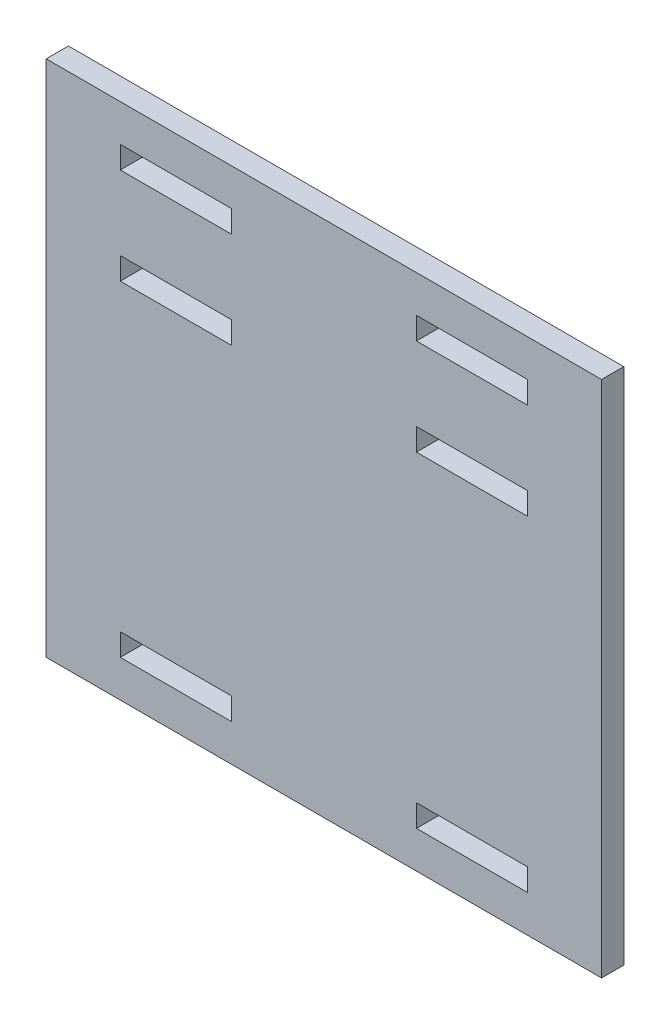
ISO-10303-21;
HEADER;
FILE_DESCRIPTION(('STEP AP214'),'2;1');
FILE_NAME('part.step','',(''),(''),'','','');
FILE_SCHEMA(('AUTOMOTIVE_DESIGN { 1 0 10303 214 1 1 1 1 }'));
ENDSEC;
DATA;
#1=APPLICATION_CONTEXT('core data for automotive mechanical design processes');
#2=APPLICATION_PROTOCOL_DEFINITION('international standard','automotive_design',2000,#1);
#3=PRODUCT_CONTEXT('',#1,'mechanical');
#4=PRODUCT('Part','Part','',(#3));
#5=PRODUCT_RELATED_PRODUCT_CATEGORY('part','',(#4));
#6=PRODUCT_DEFINITION_FORMATION('','',#4);
#7=PRODUCT_DEFINITION_CONTEXT('part definition',#1,'design');
#8=PRODUCT_DEFINITION('design','',#6,#7);
#9=PRODUCT_DEFINITION_SHAPE('','',#8);
#10=(LENGTH_UNIT() NAMED_UNIT(*) SI_UNIT(.MILLI.,.METRE.));
#11=(NAMED_UNIT(*) PLANE_ANGLE_UNIT() SI_UNIT($,.RADIAN.));
#12=(NAMED_UNIT(*) SI_UNIT($,.STERADIAN.) SOLID_ANGLE_UNIT());
#13=UNCERTAINTY_MEASURE_WITH_UNIT(LENGTH_MEASURE(1.E-05),#10,'distance_accuracy_value','');
#14=(GEOMETRIC_REPRESENTATION_CONTEXT(3) GLOBAL_UNCERTAINTY_ASSIGNED_CONTEXT((#13)) GLOBAL_UNIT_ASSIGNED_CONTEXT((#10,
#11,#12)) REPRESENTATION_CONTEXT('',''));
#15=CARTESIAN_POINT('',(0.,0.,0.));
#16=DIRECTION('',(0.,0.,1.));
#17=DIRECTION('',(1.,0.,0.));
#18=AXIS2_PLACEMENT_3D('',#15,#16,#17);
#19=CARTESIAN_POINT('',(0.,0.,3.));
#20=DIRECTION('',(0.,0.,1.));
#21=DIRECTION('',(1.,0.,0.));
#22=AXIS2_PLACEMENT_3D('',#19,#20,#21);
#23=PLANE('',#22);
#24=DIRECTION('',(1.,0.,0.));
#25=VECTOR('',#24,1.);
#26=CARTESIAN_POINT('',(-40.1836734693878,11.1632653061225,3.));
#27=LINE('',#26,#25);
#28=CARTESIAN_POINT('',(-40.1836734693878,11.1632653061225,3.));
#29=VERTEX_POINT('',#28);
#30=CARTESIAN_POINT('',(-25.1836734693878,11.1632653061225,3.));
#31=VERTEX_POINT('',#30);
#32=EDGE_CURVE('E258',#29,#31,#27,.T.);
#33=ORIENTED_EDGE('',*,*,#32,.F.);
#34=DIRECTION('',(0.,-1.,0.));
#35=VECTOR('',#34,1.);
#36=CARTESIAN_POINT('',(-40.1836734693878,14.1632653061225,3.));
#37=LINE('',#36,#35);
#38=CARTESIAN_POINT('',(-40.1836734693878,14.1632653061225,3.));
#39=VERTEX_POINT('',#38);
#40=EDGE_CURVE('E256',#39,#29,#37,.T.);
#41=ORIENTED_EDGE('',*,*,#40,.F.);
#42=DIRECTION('',(-1.,0.,0.));
#43=VECTOR('',#42,1.);
#44=CARTESIAN_POINT('',(-40.1836734693878,14.1632653061225,3.));
#45=LINE('',#44,#43);
#46=CARTESIAN_POINT('',(-25.1836734693878,14.1632653061225,3.));
#47=VERTEX_POINT('',#46);
#48=EDGE_CURVE('E264',#47,#39,#45,.T.);
#49=ORIENTED_EDGE('',*,*,#48,.F.);
#50=DIRECTION('',(0.,1.,0.));
#51=VECTOR('',#50,1.);
#52=CARTESIAN_POINT('',(-25.1836734693878,14.1632653061225,3.));
#53=LINE('',#52,#51);
#54=EDGE_CURVE('E261',#31,#47,#53,.T.);
#55=ORIENTED_EDGE('',*,*,#54,.F.);
#56=EDGE_LOOP('',(#33,#41,#49,#55));
#57=FACE_BOUND('',#56,.T.);
#58=DIRECTION('',(1.,0.,0.));
#59=VECTOR('',#58,1.);
#60=CARTESIAN_POINT('',(-0.183673469387754,-32.8367346938776,3.));
#61=LINE('',#60,#59);
#62=CARTESIAN_POINT('',(-0.183673469387754,-32.8367346938776,3.));
#63=VERTEX_POINT('',#62);
#64=CARTESIAN_POINT('',(14.8163265306122,-32.8367346938776,3.));
#65=VERTEX_POINT('',#64);
#66=EDGE_CURVE('E320',#63,#65,#61,.T.);
#67=ORIENTED_EDGE('',*,*,#66,.F.);
#68=DIRECTION('',(0.,-1.,0.));
#69=VECTOR('',#68,1.);
#70=CARTESIAN_POINT('',(-0.183673469387755,-29.8367346938776,3.));
#71=LINE('',#70,#69);
#72=CARTESIAN_POINT('',(-0.183673469387755,-29.8367346938776,3.));
#73=VERTEX_POINT('',#72);
#74=EDGE_CURVE('E318',#73,#63,#71,.T.);
#75=ORIENTED_EDGE('',*,*,#74,.F.);
#76=DIRECTION('',(-1.,0.,0.));
#77=VECTOR('',#76,1.);
#78=CARTESIAN_POINT('',(-0.183673469387755,-29.8367346938776,3.));
#79=LINE('',#78,#77);
#80=CARTESIAN_POINT('',(14.8163265306122,-29.8367346938776,3.));
#81=VERTEX_POINT('',#80);
#82=EDGE_CURVE('E326',#81,#73,#79,.T.);
#83=ORIENTED_EDGE('',*,*,#82,.F.);
#84=DIRECTION('',(0.,1.,0.));
#85=VECTOR('',#84,1.);
#86=CARTESIAN_POINT('',(14.8163265306122,-29.8367346938776,3.));
#87=LINE('',#86,#85);
#88=EDGE_CURVE('E323',#65,#81,#87,.T.);
#89=ORIENTED_EDGE('',*,*,#88,.F.);
#90=EDGE_LOOP('',(#67,#75,#83,#89));
#91=FACE_BOUND('',#90,.T.);
#92=DIRECTION('',(1.,0.,0.));
#93=VECTOR('',#92,1.);
#94=CARTESIAN_POINT('',(-40.1836734693878,24.1632653061225,3.));
#95=LINE('',#94,#93);
#96=CARTESIAN_POINT('',(-40.1836734693878,24.1632653061225,3.));
#97=VERTEX_POINT('',#96);
#98=CARTESIAN_POINT('',(-25.1836734693878,24.1632653061225,3.));
#99=VERTEX_POINT('',#98);
#100=EDGE_CURVE('E382',#97,#99,#95,.T.);
#101=ORIENTED_EDGE('',*,*,#100,.F.);
#102=DIRECTION('',(0.,-1.,0.));
#103=VECTOR('',#102,1.);
#104=CARTESIAN_POINT('',(-40.1836734693878,27.1632653061225,3.));
#105=LINE('',#104,#103);
#106=CARTESIAN_POINT('',(-40.1836734693878,27.1632653061225,3.));
#107=VERTEX_POINT('',#106);
#108=EDGE_CURVE('E380',#107,#97,#105,.T.);
#109=ORIENTED_EDGE('',*,*,#108,.F.);
#110=DIRECTION('',(-1.,0.,0.));
#111=VECTOR('',#110,1.);
#112=CARTESIAN_POINT('',(-40.1836734693878,27.1632653061225,3.));
#113=LINE('',#112,#111);
#114=CARTESIAN_POINT('',(-25.1836734693878,27.1632653061225,3.));
#115=VERTEX_POINT('',#114);
#116=EDGE_CURVE('E388',#115,#107,#113,.T.);
#117=ORIENTED_EDGE('',*,*,#116,.F.);
#118=DIRECTION('',(0.,1.,0.));
#119=VECTOR('',#118,1.);
#120=CARTESIAN_POINT('',(-25.1836734693878,27.1632653061225,3.));
#121=LINE('',#120,#119);
#122=EDGE_CURVE('E385',#99,#115,#121,.T.);
#123=ORIENTED_EDGE('',*,*,#122,.F.);
#124=EDGE_LOOP('',(#101,#109,#117,#123));
#125=FACE_BOUND('',#124,.T.);
#126=DIRECTION('',(0.,-1.,0.));
#127=VECTOR('',#126,1.);
#128=CARTESIAN_POINT('',(-50.1836734693878,32.1632653061225,3.));
#129=LINE('',#128,#127);
#130=CARTESIAN_POINT('',(-50.1836734693878,32.1632653061225,3.));
#131=VERTEX_POINT('',#130);
#132=CARTESIAN_POINT('',(-50.1836734693878,-37.8367346938776,3.));
#133=VERTEX_POINT('',#132);
#134=EDGE_CURVE('E411',#131,#133,#129,.T.);
#135=ORIENTED_EDGE('',*,*,#134,.T.);
#136=DIRECTION('',(1.,0.,0.));
#137=VECTOR('',#136,1.);
#138=CARTESIAN_POINT('',(-50.1836734693878,-37.8367346938776,3.));
#139=LINE('',#138,#137);
#140=CARTESIAN_POINT('',(24.8163265306122,-37.8367346938776,3.));
#141=VERTEX_POINT('',#140);
#142=EDGE_CURVE('E414',#133,#141,#139,.T.);
#143=ORIENTED_EDGE('',*,*,#142,.T.);
#144=DIRECTION('',(0.,1.,0.));
#145=VECTOR('',#144,1.);
#146=CARTESIAN_POINT('',(24.8163265306122,32.1632653061225,3.));
#147=LINE('',#146,#145);
#148=CARTESIAN_POINT('',(24.8163265306122,32.1632653061225,3.));
#149=VERTEX_POINT('',#148);
#150=EDGE_CURVE('E417',#141,#149,#147,.T.);
#151=ORIENTED_EDGE('',*,*,#150,.T.);
#152=DIRECTION('',(-1.,0.,0.));
#153=VECTOR('',#152,1.);
#154=CARTESIAN_POINT('',(-50.1836734693878,32.1632653061225,3.));
#155=LINE('',#154,#153);
#156=EDGE_CURVE('E419',#149,#131,#155,.T.);
#157=ORIENTED_EDGE('',*,*,#156,.T.);
#158=EDGE_LOOP('',(#135,#143,#151,#157));
#159=FACE_BOUND('',#158,.T.);
#160=DIRECTION('',(1.,0.,0.));
#161=VECTOR('',#160,1.);
#162=CARTESIAN_POINT('',(-0.18367346938776,24.1632653061225,3.));
#163=LINE('',#162,#161);
#164=CARTESIAN_POINT('',(-0.18367346938776,24.1632653061225,3.));
#165=VERTEX_POINT('',#164);
#166=CARTESIAN_POINT('',(14.8163265306122,24.1632653061225,3.));
#167=VERTEX_POINT('',#166);
#168=EDGE_CURVE('E351',#165,#167,#163,.T.);
#169=ORIENTED_EDGE('',*,*,#168,.F.);
#170=DIRECTION('',(0.,-1.,0.));
#171=VECTOR('',#170,1.);
#172=CARTESIAN_POINT('',(-0.18367346938776,27.1632653061225,3.));
#173=LINE('',#172,#171);
#174=CARTESIAN_POINT('',(-0.18367346938776,27.1632653061225,3.));
#175=VERTEX_POINT('',#174);
#176=EDGE_CURVE('E349',#175,#165,#173,.T.);
#177=ORIENTED_EDGE('',*,*,#176,.F.);
#178=DIRECTION('',(-1.,0.,0.));
#179=VECTOR('',#178,1.);
#180=CARTESIAN_POINT('',(-0.18367346938776,27.1632653061225,3.));
#181=LINE('',#180,#179);
#182=CARTESIAN_POINT('',(14.8163265306122,27.1632653061225,3.));
#183=VERTEX_POINT('',#182);
#184=EDGE_CURVE('E357',#183,#175,#181,.T.);
#185=ORIENTED_EDGE('',*,*,#184,.F.);
#186=DIRECTION('',(0.,1.,0.));
#187=VECTOR('',#186,1.);
#188=CARTESIAN_POINT('',(14.8163265306122,27.1632653061225,3.));
#189=LINE('',#188,#187);
#190=EDGE_CURVE('E354',#167,#183,#189,.T.);
#191=ORIENTED_EDGE('',*,*,#190,.F.);
#192=EDGE_LOOP('',(#169,#177,#185,#191));
#193=FACE_BOUND('',#192,.T.);
#194=DIRECTION('',(-1.,0.,0.));
#195=VECTOR('',#194,1.);
#196=CARTESIAN_POINT('',(-25.1836734693878,-29.8367346938776,3.));
#197=LINE('',#196,#195);
#198=CARTESIAN_POINT('',(-25.1836734693878,-29.8367346938776,3.));
#199=VERTEX_POINT('',#198);
#200=CARTESIAN_POINT('',(-40.1836734693878,-29.8367346938776,3.));
#201=VERTEX_POINT('',#200);
#202=EDGE_CURVE('E289',#199,#201,#197,.T.);
#203=ORIENTED_EDGE('',*,*,#202,.F.);
#204=DIRECTION('',(0.,1.,0.));
#205=VECTOR('',#204,1.);
#206=CARTESIAN_POINT('',(-25.1836734693878,-29.8367346938776,3.));
#207=LINE('',#206,#205);
#208=CARTESIAN_POINT('',(-25.1836734693878,-32.8367346938776,3.));
#209=VERTEX_POINT('',#208);
#210=EDGE_CURVE('E287',#209,#199,#207,.T.);
#211=ORIENTED_EDGE('',*,*,#210,.F.);
#212=DIRECTION('',(1.,0.,0.));
#213=VECTOR('',#212,1.);
#214=CARTESIAN_POINT('',(-25.1836734693878,-32.8367346938776,3.));
#215=LINE('',#214,#213);
#216=CARTESIAN_POINT('',(-40.1836734693878,-32.8367346938776,3.));
#217=VERTEX_POINT('',#216);
#218=EDGE_CURVE('E295',#217,#209,#215,.T.);
#219=ORIENTED_EDGE('',*,*,#218,.F.);
#220=DIRECTION('',(0.,-1.,0.));
#221=VECTOR('',#220,1.);
#222=CARTESIAN_POINT('',(-40.1836734693878,-29.8367346938776,3.));
#223=LINE('',#222,#221);
#224=EDGE_CURVE('E292',#201,#217,#223,.T.);
#225=ORIENTED_EDGE('',*,*,#224,.F.);
#226=EDGE_LOOP('',(#203,#211,#219,#225));
#227=FACE_BOUND('',#226,.T.);
#228=DIRECTION('',(1.,0.,0.));
#229=VECTOR('',#228,1.);
#230=CARTESIAN_POINT('',(-0.18367346938776,11.1632653061225,3.));
#231=LINE('',#230,#229);
#232=CARTESIAN_POINT('',(-0.18367346938776,11.1632653061225,3.));
#233=VERTEX_POINT('',#232);
#234=CARTESIAN_POINT('',(14.8163265306122,11.1632653061225,3.));
#235=VERTEX_POINT('',#234);
#236=EDGE_CURVE('E228',#233,#235,#231,.T.);
#237=ORIENTED_EDGE('',*,*,#236,.F.);
#238=DIRECTION('',(0.,-1.,0.));
#239=VECTOR('',#238,1.);
#240=CARTESIAN_POINT('',(-0.18367346938776,11.1632653061225,3.));
#241=LINE('',#240,#239);
#242=CARTESIAN_POINT('',(-0.18367346938776,14.1632653061225,3.));
#243=VERTEX_POINT('',#242);
#244=EDGE_CURVE('E220',#243,#233,#241,.T.);
#245=ORIENTED_EDGE('',*,*,#244,.F.);
#246=DIRECTION('',(-1.,0.,0.));
#247=VECTOR('',#246,1.);
#248=CARTESIAN_POINT('',(-0.18367346938776,14.1632653061225,3.));
#249=LINE('',#248,#247);
#250=CARTESIAN_POINT('',(14.8163265306122,14.1632653061225,3.));
#251=VERTEX_POINT('',#250);
#252=EDGE_CURVE('E242',#251,#243,#249,.T.);
#253=ORIENTED_EDGE('',*,*,#252,.F.);
#254=DIRECTION('',(0.,1.,0.));
#255=VECTOR('',#254,1.);
#256=CARTESIAN_POINT('',(14.8163265306122,11.1632653061225,3.));
#257=LINE('',#256,#255);
#258=EDGE_CURVE('E240',#235,#251,#257,.T.);
#259=ORIENTED_EDGE('',*,*,#258,.F.);
#260=EDGE_LOOP('',(#237,#245,#253,#259));
#261=FACE_BOUND('',#260,.T.);
#262=ADVANCED_FACE('F35',(#57,#91,#125,#159,#193,#227,#261),#23,.T.);
#263=CARTESIAN_POINT('',(0.,0.,0.));
#264=DIRECTION('',(0.,0.,1.));
#265=DIRECTION('',(1.,0.,0.));
#266=AXIS2_PLACEMENT_3D('',#263,#264,#265);
#267=PLANE('',#266);
#268=DIRECTION('',(0.,-1.,0.));
#269=VECTOR('',#268,1.);
#270=CARTESIAN_POINT('',(-40.1836734693878,14.1632653061225,0.));
#271=LINE('',#270,#269);
#272=CARTESIAN_POINT('',(-40.1836734693878,14.1632653061225,0.));
#273=VERTEX_POINT('',#272);
#274=CARTESIAN_POINT('',(-40.1836734693878,11.1632653061225,0.));
#275=VERTEX_POINT('',#274);
#276=EDGE_CURVE('E236',#273,#275,#271,.T.);
#277=ORIENTED_EDGE('',*,*,#276,.T.);
#278=DIRECTION('',(1.,0.,0.));
#279=VECTOR('',#278,1.);
#280=CARTESIAN_POINT('',(-40.1836734693878,11.1632653061225,0.));
#281=LINE('',#280,#279);
#282=CARTESIAN_POINT('',(-25.1836734693878,11.1632653061225,0.));
#283=VERTEX_POINT('',#282);
#284=EDGE_CURVE('E269',#275,#283,#281,.T.);
#285=ORIENTED_EDGE('',*,*,#284,.T.);
#286=DIRECTION('',(0.,1.,0.));
#287=VECTOR('',#286,1.);
#288=CARTESIAN_POINT('',(-25.1836734693878,14.1632653061225,0.));
#289=LINE('',#288,#287);
#290=CARTESIAN_POINT('',(-25.1836734693878,14.1632653061225,0.));
#291=VERTEX_POINT('',#290);
#292=EDGE_CURVE('E272',#283,#291,#289,.T.);
#293=ORIENTED_EDGE('',*,*,#292,.T.);
#294=DIRECTION('',(-1.,0.,0.));
#295=VECTOR('',#294,1.);
#296=CARTESIAN_POINT('',(-40.1836734693878,14.1632653061225,0.));
#297=LINE('',#296,#295);
#298=EDGE_CURVE('E259',#291,#273,#297,.T.);
#299=ORIENTED_EDGE('',*,*,#298,.T.);
#300=EDGE_LOOP('',(#277,#285,#293,#299));
#301=FACE_BOUND('',#300,.T.);
#302=DIRECTION('',(0.,-1.,0.));
#303=VECTOR('',#302,1.);
#304=CARTESIAN_POINT('',(-0.183673469387755,-29.8367346938776,0.));
#305=LINE('',#304,#303);
#306=CARTESIAN_POINT('',(-0.183673469387755,-29.8367346938776,0.));
#307=VERTEX_POINT('',#306);
#308=CARTESIAN_POINT('',(-0.183673469387754,-32.8367346938776,0.));
#309=VERTEX_POINT('',#308);
#310=EDGE_CURVE('E317',#307,#309,#305,.T.);
#311=ORIENTED_EDGE('',*,*,#310,.T.);
#312=DIRECTION('',(1.,0.,0.));
#313=VECTOR('',#312,1.);
#314=CARTESIAN_POINT('',(-0.183673469387754,-32.8367346938776,0.));
#315=LINE('',#314,#313);
#316=CARTESIAN_POINT('',(14.8163265306122,-32.8367346938776,0.));
#317=VERTEX_POINT('',#316);
#318=EDGE_CURVE('E331',#309,#317,#315,.T.);
#319=ORIENTED_EDGE('',*,*,#318,.T.);
#320=DIRECTION('',(0.,1.,0.));
#321=VECTOR('',#320,1.);
#322=CARTESIAN_POINT('',(14.8163265306122,-29.8367346938776,0.));
#323=LINE('',#322,#321);
#324=CARTESIAN_POINT('',(14.8163265306122,-29.8367346938776,0.));
#325=VERTEX_POINT('',#324);
#326=EDGE_CURVE('E334',#317,#325,#323,.T.);
#327=ORIENTED_EDGE('',*,*,#326,.T.);
#328=DIRECTION('',(-1.,0.,0.));
#329=VECTOR('',#328,1.);
#330=CARTESIAN_POINT('',(-0.183673469387755,-29.8367346938776,0.));
#331=LINE('',#330,#329);
#332=EDGE_CURVE('E321',#325,#307,#331,.T.);
#333=ORIENTED_EDGE('',*,*,#332,.T.);
#334=EDGE_LOOP('',(#311,#319,#327,#333));
#335=FACE_BOUND('',#334,.T.);
#336=DIRECTION('',(0.,-1.,0.));
#337=VECTOR('',#336,1.);
#338=CARTESIAN_POINT('',(-40.1836734693878,27.1632653061225,0.));
#339=LINE('',#338,#337);
#340=CARTESIAN_POINT('',(-40.1836734693878,27.1632653061225,0.));
#341=VERTEX_POINT('',#340);
#342=CARTESIAN_POINT('',(-40.1836734693878,24.1632653061225,0.));
#343=VERTEX_POINT('',#342);
#344=EDGE_CURVE('E379',#341,#343,#339,.T.);
#345=ORIENTED_EDGE('',*,*,#344,.T.);
#346=DIRECTION('',(1.,0.,0.));
#347=VECTOR('',#346,1.);
#348=CARTESIAN_POINT('',(-40.1836734693878,24.1632653061225,0.));
#349=LINE('',#348,#347);
#350=CARTESIAN_POINT('',(-25.1836734693878,24.1632653061225,0.));
#351=VERTEX_POINT('',#350);
#352=EDGE_CURVE('E393',#343,#351,#349,.T.);
#353=ORIENTED_EDGE('',*,*,#352,.T.);
#354=DIRECTION('',(0.,1.,0.));
#355=VECTOR('',#354,1.);
#356=CARTESIAN_POINT('',(-25.1836734693878,27.1632653061225,0.));
#357=LINE('',#356,#355);
#358=CARTESIAN_POINT('',(-25.1836734693878,27.1632653061225,0.));
#359=VERTEX_POINT('',#358);
#360=EDGE_CURVE('E396',#351,#359,#357,.T.);
#361=ORIENTED_EDGE('',*,*,#360,.T.);
#362=DIRECTION('',(-1.,0.,0.));
#363=VECTOR('',#362,1.);
#364=CARTESIAN_POINT('',(-40.1836734693878,27.1632653061225,0.));
#365=LINE('',#364,#363);
#366=EDGE_CURVE('E383',#359,#341,#365,.T.);
#367=ORIENTED_EDGE('',*,*,#366,.T.);
#368=EDGE_LOOP('',(#345,#353,#361,#367));
#369=FACE_BOUND('',#368,.T.);
#370=DIRECTION('',(0.,-1.,0.));
#371=VECTOR('',#370,1.);
#372=CARTESIAN_POINT('',(-50.1836734693878,32.1632653061225,0.));
#373=LINE('',#372,#371);
#374=CARTESIAN_POINT('',(-50.1836734693878,32.1632653061225,0.));
#375=VERTEX_POINT('',#374);
#376=CARTESIAN_POINT('',(-50.1836734693878,-37.8367346938776,0.));
#377=VERTEX_POINT('',#376);
#378=EDGE_CURVE('E410',#375,#377,#373,.T.);
#379=ORIENTED_EDGE('',*,*,#378,.F.);
#380=DIRECTION('',(-1.,0.,0.));
#381=VECTOR('',#380,1.);
#382=CARTESIAN_POINT('',(-50.1836734693878,32.1632653061225,0.));
#383=LINE('',#382,#381);
#384=CARTESIAN_POINT('',(24.8163265306122,32.1632653061225,0.));
#385=VERTEX_POINT('',#384);
#386=EDGE_CURVE('E415',#385,#375,#383,.T.);
#387=ORIENTED_EDGE('',*,*,#386,.F.);
#388=DIRECTION('',(0.,1.,0.));
#389=VECTOR('',#388,1.);
#390=CARTESIAN_POINT('',(24.8163265306122,32.1632653061225,0.));
#391=LINE('',#390,#389);
#392=CARTESIAN_POINT('',(24.8163265306122,-37.8367346938776,0.));
#393=VERTEX_POINT('',#392);
#394=EDGE_CURVE('E426',#393,#385,#391,.T.);
#395=ORIENTED_EDGE('',*,*,#394,.F.);
#396=DIRECTION('',(1.,0.,0.));
#397=VECTOR('',#396,1.);
#398=CARTESIAN_POINT('',(-50.1836734693878,-37.8367346938776,0.));
#399=LINE('',#398,#397);
#400=EDGE_CURVE('E424',#377,#393,#399,.T.);
#401=ORIENTED_EDGE('',*,*,#400,.F.);
#402=EDGE_LOOP('',(#379,#387,#395,#401));
#403=FACE_BOUND('',#402,.T.);
#404=DIRECTION('',(0.,-1.,0.));
#405=VECTOR('',#404,1.);
#406=CARTESIAN_POINT('',(-0.18367346938776,27.1632653061225,0.));
#407=LINE('',#406,#405);
#408=CARTESIAN_POINT('',(-0.18367346938776,27.1632653061225,0.));
#409=VERTEX_POINT('',#408);
#410=CARTESIAN_POINT('',(-0.18367346938776,24.1632653061225,0.));
#411=VERTEX_POINT('',#410);
#412=EDGE_CURVE('E348',#409,#411,#407,.T.);
#413=ORIENTED_EDGE('',*,*,#412,.T.);
#414=DIRECTION('',(1.,0.,0.));
#415=VECTOR('',#414,1.);
#416=CARTESIAN_POINT('',(-0.18367346938776,24.1632653061225,0.));
#417=LINE('',#416,#415);
#418=CARTESIAN_POINT('',(14.8163265306122,24.1632653061225,0.));
#419=VERTEX_POINT('',#418);
#420=EDGE_CURVE('E362',#411,#419,#417,.T.);
#421=ORIENTED_EDGE('',*,*,#420,.T.);
#422=DIRECTION('',(0.,1.,0.));
#423=VECTOR('',#422,1.);
#424=CARTESIAN_POINT('',(14.8163265306122,27.1632653061225,0.));
#425=LINE('',#424,#423);
#426=CARTESIAN_POINT('',(14.8163265306122,27.1632653061225,0.));
#427=VERTEX_POINT('',#426);
#428=EDGE_CURVE('E365',#419,#427,#425,.T.);
#429=ORIENTED_EDGE('',*,*,#428,.T.);
#430=DIRECTION('',(-1.,0.,0.));
#431=VECTOR('',#430,1.);
#432=CARTESIAN_POINT('',(-0.18367346938776,27.1632653061225,0.));
#433=LINE('',#432,#431);
#434=EDGE_CURVE('E352',#427,#409,#433,.T.);
#435=ORIENTED_EDGE('',*,*,#434,.T.);
#436=EDGE_LOOP('',(#413,#421,#429,#435));
#437=FACE_BOUND('',#436,.T.);
#438=DIRECTION('',(0.,1.,0.));
#439=VECTOR('',#438,1.);
#440=CARTESIAN_POINT('',(-25.1836734693878,-29.8367346938776,0.));
#441=LINE('',#440,#439);
#442=CARTESIAN_POINT('',(-25.1836734693878,-32.8367346938776,0.));
#443=VERTEX_POINT('',#442);
#444=CARTESIAN_POINT('',(-25.1836734693878,-29.8367346938776,0.));
#445=VERTEX_POINT('',#444);
#446=EDGE_CURVE('E286',#443,#445,#441,.T.);
#447=ORIENTED_EDGE('',*,*,#446,.T.);
#448=DIRECTION('',(-1.,0.,0.));
#449=VECTOR('',#448,1.);
#450=CARTESIAN_POINT('',(-25.1836734693878,-29.8367346938776,0.));
#451=LINE('',#450,#449);
#452=CARTESIAN_POINT('',(-40.1836734693878,-29.8367346938776,0.));
#453=VERTEX_POINT('',#452);
#454=EDGE_CURVE('E300',#445,#453,#451,.T.);
#455=ORIENTED_EDGE('',*,*,#454,.T.);
#456=DIRECTION('',(0.,-1.,0.));
#457=VECTOR('',#456,1.);
#458=CARTESIAN_POINT('',(-40.1836734693878,-29.8367346938776,0.));
#459=LINE('',#458,#457);
#460=CARTESIAN_POINT('',(-40.1836734693878,-32.8367346938776,0.));
#461=VERTEX_POINT('',#460);
#462=EDGE_CURVE('E303',#453,#461,#459,.T.);
#463=ORIENTED_EDGE('',*,*,#462,.T.);
#464=DIRECTION('',(1.,0.,0.));
#465=VECTOR('',#464,1.);
#466=CARTESIAN_POINT('',(-25.1836734693878,-32.8367346938776,0.));
#467=LINE('',#466,#465);
#468=EDGE_CURVE('E290',#461,#443,#467,.T.);
#469=ORIENTED_EDGE('',*,*,#468,.T.);
#470=EDGE_LOOP('',(#447,#455,#463,#469));
#471=FACE_BOUND('',#470,.T.);
#472=DIRECTION('',(0.,-1.,0.));
#473=VECTOR('',#472,1.);
#474=CARTESIAN_POINT('',(-0.18367346938776,11.1632653061225,0.));
#475=LINE('',#474,#473);
#476=CARTESIAN_POINT('',(-0.18367346938776,14.1632653061225,0.));
#477=VERTEX_POINT('',#476);
#478=CARTESIAN_POINT('',(-0.18367346938776,11.1632653061225,0.));
#479=VERTEX_POINT('',#478);
#480=EDGE_CURVE('E58',#477,#479,#475,.T.);
#481=ORIENTED_EDGE('',*,*,#480,.T.);
#482=DIRECTION('',(1.,0.,0.));
#483=VECTOR('',#482,1.);
#484=CARTESIAN_POINT('',(-0.18367346938776,11.1632653061225,0.));
#485=LINE('',#484,#483);
#486=CARTESIAN_POINT('',(14.8163265306122,11.1632653061225,0.));
#487=VERTEX_POINT('',#486);
#488=EDGE_CURVE('E235',#479,#487,#485,.T.);
#489=ORIENTED_EDGE('',*,*,#488,.T.);
#490=DIRECTION('',(0.,1.,0.));
#491=VECTOR('',#490,1.);
#492=CARTESIAN_POINT('',(14.8163265306122,11.1632653061225,0.));
#493=LINE('',#492,#491);
#494=CARTESIAN_POINT('',(14.8163265306122,14.1632653061225,0.));
#495=VERTEX_POINT('',#494);
#496=EDGE_CURVE('E248',#487,#495,#493,.T.);
#497=ORIENTED_EDGE('',*,*,#496,.T.);
#498=DIRECTION('',(-1.,0.,0.));
#499=VECTOR('',#498,1.);
#500=CARTESIAN_POINT('',(-0.18367346938776,14.1632653061225,0.));
#501=LINE('',#500,#499);
#502=EDGE_CURVE('E229',#495,#477,#501,.T.);
#503=ORIENTED_EDGE('',*,*,#502,.T.);
#504=EDGE_LOOP('',(#481,#489,#497,#503));
#505=FACE_BOUND('',#504,.T.);
#506=ADVANCED_FACE('F444',(#301,#335,#369,#403,#437,#471,#505),#267,.F.);
#507=CARTESIAN_POINT('',(-50.1836734693878,32.1632653061225,3.));
#508=DIRECTION('',(1.,0.,0.));
#509=DIRECTION('',(0.,1.,0.));
#510=AXIS2_PLACEMENT_3D('',#507,#508,#509);
#511=PLANE('',#510);
#512=ORIENTED_EDGE('',*,*,#378,.T.);
#513=DIRECTION('',(0.,0.,-1.));
#514=VECTOR('',#513,1.);
#515=CARTESIAN_POINT('',(-50.1836734693878,-37.8367346938776,3.));
#516=LINE('',#515,#514);
#517=EDGE_CURVE('E11',#133,#377,#516,.T.);
#518=ORIENTED_EDGE('',*,*,#517,.F.);
#519=ORIENTED_EDGE('',*,*,#134,.F.);
#520=DIRECTION('',(0.,0.,-1.));
#521=VECTOR('',#520,1.);
#522=CARTESIAN_POINT('',(-50.1836734693878,32.1632653061225,3.));
#523=LINE('',#522,#521);
#524=EDGE_CURVE('E421',#131,#375,#523,.T.);
#525=ORIENTED_EDGE('',*,*,#524,.T.);
#526=EDGE_LOOP('',(#512,#518,#519,#525));
#527=FACE_BOUND('',#526,.T.);
#528=ADVANCED_FACE('F37',(#527),#511,.F.);
#529=CARTESIAN_POINT('',(-50.1836734693878,-37.8367346938776,3.));
#530=DIRECTION('',(0.,1.,0.));
#531=DIRECTION('',(0.,0.,1.));
#532=AXIS2_PLACEMENT_3D('',#529,#530,#531);
#533=PLANE('',#532);
#534=ORIENTED_EDGE('',*,*,#400,.T.);
#535=DIRECTION('',(0.,0.,-1.));
#536=VECTOR('',#535,1.);
#537=CARTESIAN_POINT('',(24.8163265306122,-37.8367346938776,3.));
#538=LINE('',#537,#536);
#539=EDGE_CURVE('E43',#141,#393,#538,.T.);
#540=ORIENTED_EDGE('',*,*,#539,.F.);
#541=ORIENTED_EDGE('',*,*,#142,.F.);
#542=ORIENTED_EDGE('',*,*,#517,.T.);
#543=EDGE_LOOP('',(#534,#540,#541,#542));
#544=FACE_BOUND('',#543,.T.);
#545=ADVANCED_FACE('F455',(#544),#533,.F.);
#546=CARTESIAN_POINT('',(24.8163265306122,32.1632653061225,3.));
#547=DIRECTION('',(-1.,0.,0.));
#548=DIRECTION('',(0.,-1.,0.));
#549=AXIS2_PLACEMENT_3D('',#546,#547,#548);
#550=PLANE('',#549);
#551=ORIENTED_EDGE('',*,*,#394,.T.);
#552=DIRECTION('',(0.,0.,-1.));
#553=VECTOR('',#552,1.);
#554=CARTESIAN_POINT('',(24.8163265306122,32.1632653061225,3.));
#555=LINE('',#554,#553);
#556=EDGE_CURVE('E431',#149,#385,#555,.T.);
#557=ORIENTED_EDGE('',*,*,#556,.F.);
#558=ORIENTED_EDGE('',*,*,#150,.F.);
#559=ORIENTED_EDGE('',*,*,#539,.T.);
#560=EDGE_LOOP('',(#551,#557,#558,#559));
#561=FACE_BOUND('',#560,.T.);
#562=ADVANCED_FACE('F438',(#561),#550,.F.);
#563=CARTESIAN_POINT('',(-50.1836734693878,32.1632653061225,3.));
#564=DIRECTION('',(0.,-1.,0.));
#565=DIRECTION('',(0.,0.,-1.));
#566=AXIS2_PLACEMENT_3D('',#563,#564,#565);
#567=PLANE('',#566);
#568=ORIENTED_EDGE('',*,*,#386,.T.);
#569=ORIENTED_EDGE('',*,*,#524,.F.);
#570=ORIENTED_EDGE('',*,*,#156,.F.);
#571=ORIENTED_EDGE('',*,*,#556,.T.);
#572=EDGE_LOOP('',(#568,#569,#570,#571));
#573=FACE_BOUND('',#572,.T.);
#574=ADVANCED_FACE('F448',(#573),#567,.F.);
#575=CARTESIAN_POINT('',(-40.1836734693878,27.1632653061225,3.));
#576=DIRECTION('',(1.,0.,0.));
#577=DIRECTION('',(0.,0.,-1.));
#578=AXIS2_PLACEMENT_3D('',#575,#576,#577);
#579=PLANE('',#578);
#580=ORIENTED_EDGE('',*,*,#344,.F.);
#581=DIRECTION('',(0.,0.,-1.));
#582=VECTOR('',#581,1.);
#583=CARTESIAN_POINT('',(-40.1836734693878,27.1632653061225,3.));
#584=LINE('',#583,#582);
#585=EDGE_CURVE('E390',#107,#341,#584,.T.);
#586=ORIENTED_EDGE('',*,*,#585,.F.);
#587=ORIENTED_EDGE('',*,*,#108,.T.);
#588=DIRECTION('',(0.,0.,-1.));
#589=VECTOR('',#588,1.);
#590=CARTESIAN_POINT('',(-40.1836734693878,24.1632653061225,3.));
#591=LINE('',#590,#589);
#592=EDGE_CURVE('E407',#97,#343,#591,.T.);
#593=ORIENTED_EDGE('',*,*,#592,.T.);
#594=EDGE_LOOP('',(#580,#586,#587,#593));
#595=FACE_BOUND('',#594,.T.);
#596=ADVANCED_FACE('F473',(#595),#579,.T.);
#597=CARTESIAN_POINT('',(-40.1836734693878,24.1632653061225,3.));
#598=DIRECTION('',(0.,1.,0.));
#599=DIRECTION('',(0.,0.,1.));
#600=AXIS2_PLACEMENT_3D('',#597,#598,#599);
#601=PLANE('',#600);
#602=ORIENTED_EDGE('',*,*,#352,.F.);
#603=ORIENTED_EDGE('',*,*,#592,.F.);
#604=ORIENTED_EDGE('',*,*,#100,.T.);
#605=DIRECTION('',(0.,0.,-1.));
#606=VECTOR('',#605,1.);
#607=CARTESIAN_POINT('',(-25.1836734693878,24.1632653061225,3.));
#608=LINE('',#607,#606);
#609=EDGE_CURVE('E405',#99,#351,#608,.T.);
#610=ORIENTED_EDGE('',*,*,#609,.T.);
#611=EDGE_LOOP('',(#602,#603,#604,#610));
#612=FACE_BOUND('',#611,.T.);
#613=ADVANCED_FACE('F480',(#612),#601,.T.);
#614=CARTESIAN_POINT('',(-25.1836734693878,27.1632653061225,3.));
#615=DIRECTION('',(-1.,0.,0.));
#616=DIRECTION('',(0.,0.,1.));
#617=AXIS2_PLACEMENT_3D('',#614,#615,#616);
#618=PLANE('',#617);
#619=ORIENTED_EDGE('',*,*,#360,.F.);
#620=ORIENTED_EDGE('',*,*,#609,.F.);
#621=ORIENTED_EDGE('',*,*,#122,.T.);
#622=DIRECTION('',(0.,0.,-1.));
#623=VECTOR('',#622,1.);
#624=CARTESIAN_POINT('',(-25.1836734693878,27.1632653061225,3.));
#625=LINE('',#624,#623);
#626=EDGE_CURVE('E403',#115,#359,#625,.T.);
#627=ORIENTED_EDGE('',*,*,#626,.T.);
#628=EDGE_LOOP('',(#619,#620,#621,#627));
#629=FACE_BOUND('',#628,.T.);
#630=ADVANCED_FACE('F485',(#629),#618,.T.);
#631=CARTESIAN_POINT('',(-40.1836734693878,27.1632653061225,3.));
#632=DIRECTION('',(0.,-1.,0.));
#633=DIRECTION('',(0.,0.,-1.));
#634=AXIS2_PLACEMENT_3D('',#631,#632,#633);
#635=PLANE('',#634);
#636=ORIENTED_EDGE('',*,*,#366,.F.);
#637=ORIENTED_EDGE('',*,*,#626,.F.);
#638=ORIENTED_EDGE('',*,*,#116,.T.);
#639=ORIENTED_EDGE('',*,*,#585,.T.);
#640=EDGE_LOOP('',(#636,#637,#638,#639));
#641=FACE_BOUND('',#640,.T.);
#642=ADVANCED_FACE('F493',(#641),#635,.T.);
#643=CARTESIAN_POINT('',(-0.18367346938776,27.1632653061225,3.));
#644=DIRECTION('',(1.,0.,0.));
#645=DIRECTION('',(0.,1.,0.));
#646=AXIS2_PLACEMENT_3D('',#643,#644,#645);
#647=PLANE('',#646);
#648=ORIENTED_EDGE('',*,*,#412,.F.);
#649=DIRECTION('',(0.,0.,-1.));
#650=VECTOR('',#649,1.);
#651=CARTESIAN_POINT('',(-0.18367346938776,27.1632653061225,3.));
#652=LINE('',#651,#650);
#653=EDGE_CURVE('E359',#175,#409,#652,.T.);
#654=ORIENTED_EDGE('',*,*,#653,.F.);
#655=ORIENTED_EDGE('',*,*,#176,.T.);
#656=DIRECTION('',(0.,0.,-1.));
#657=VECTOR('',#656,1.);
#658=CARTESIAN_POINT('',(-0.18367346938776,24.1632653061225,3.));
#659=LINE('',#658,#657);
#660=EDGE_CURVE('E376',#165,#411,#659,.T.);
#661=ORIENTED_EDGE('',*,*,#660,.T.);
#662=EDGE_LOOP('',(#648,#654,#655,#661));
#663=FACE_BOUND('',#662,.T.);
#664=ADVANCED_FACE('F506',(#663),#647,.T.);
#665=CARTESIAN_POINT('',(-0.18367346938776,24.1632653061225,3.));
#666=DIRECTION('',(0.,1.,0.));
#667=DIRECTION('',(0.,0.,1.));
#668=AXIS2_PLACEMENT_3D('',#665,#666,#667);
#669=PLANE('',#668);
#670=ORIENTED_EDGE('',*,*,#420,.F.);
#671=ORIENTED_EDGE('',*,*,#660,.F.);
#672=ORIENTED_EDGE('',*,*,#168,.T.);
#673=DIRECTION('',(0.,0.,-1.));
#674=VECTOR('',#673,1.);
#675=CARTESIAN_POINT('',(14.8163265306122,24.1632653061225,3.));
#676=LINE('',#675,#674);
#677=EDGE_CURVE('E374',#167,#419,#676,.T.);
#678=ORIENTED_EDGE('',*,*,#677,.T.);
#679=EDGE_LOOP('',(#670,#671,#672,#678));
#680=FACE_BOUND('',#679,.T.);
#681=ADVANCED_FACE('F511',(#680),#669,.T.);
#682=CARTESIAN_POINT('',(14.8163265306122,27.1632653061225,3.));
#683=DIRECTION('',(-1.,0.,0.));
#684=DIRECTION('',(0.,0.,1.));
#685=AXIS2_PLACEMENT_3D('',#682,#683,#684);
#686=PLANE('',#685);
#687=ORIENTED_EDGE('',*,*,#428,.F.);
#688=ORIENTED_EDGE('',*,*,#677,.F.);
#689=ORIENTED_EDGE('',*,*,#190,.T.);
#690=DIRECTION('',(0.,0.,-1.));
#691=VECTOR('',#690,1.);
#692=CARTESIAN_POINT('',(14.8163265306122,27.1632653061225,3.));
#693=LINE('',#692,#691);
#694=EDGE_CURVE('E372',#183,#427,#693,.T.);
#695=ORIENTED_EDGE('',*,*,#694,.T.);
#696=EDGE_LOOP('',(#687,#688,#689,#695));
#697=FACE_BOUND('',#696,.T.);
#698=ADVANCED_FACE('F515',(#697),#686,.T.);
#699=CARTESIAN_POINT('',(-0.18367346938776,27.1632653061225,3.));
#700=DIRECTION('',(0.,-1.,0.));
#701=DIRECTION('',(0.,0.,-1.));
#702=AXIS2_PLACEMENT_3D('',#699,#700,#701);
#703=PLANE('',#702);
#704=ORIENTED_EDGE('',*,*,#434,.F.);
#705=ORIENTED_EDGE('',*,*,#694,.F.);
#706=ORIENTED_EDGE('',*,*,#184,.T.);
#707=ORIENTED_EDGE('',*,*,#653,.T.);
#708=EDGE_LOOP('',(#704,#705,#706,#707));
#709=FACE_BOUND('',#708,.T.);
#710=ADVANCED_FACE('F519',(#709),#703,.T.);
#711=CARTESIAN_POINT('',(-0.183673469387755,-29.8367346938776,3.));
#712=DIRECTION('',(1.,0.,0.));
#713=DIRECTION('',(0.,1.,0.));
#714=AXIS2_PLACEMENT_3D('',#711,#712,#713);
#715=PLANE('',#714);
#716=ORIENTED_EDGE('',*,*,#310,.F.);
#717=DIRECTION('',(0.,0.,-1.));
#718=VECTOR('',#717,1.);
#719=CARTESIAN_POINT('',(-0.183673469387755,-29.8367346938776,3.));
#720=LINE('',#719,#718);
#721=EDGE_CURVE('E328',#73,#307,#720,.T.);
#722=ORIENTED_EDGE('',*,*,#721,.F.);
#723=ORIENTED_EDGE('',*,*,#74,.T.);
#724=DIRECTION('',(0.,0.,-1.));
#725=VECTOR('',#724,1.);
#726=CARTESIAN_POINT('',(-0.183673469387754,-32.8367346938776,3.));
#727=LINE('',#726,#725);
#728=EDGE_CURVE('E345',#63,#309,#727,.T.);
#729=ORIENTED_EDGE('',*,*,#728,.T.);
#730=EDGE_LOOP('',(#716,#722,#723,#729));
#731=FACE_BOUND('',#730,.T.);
#732=ADVANCED_FACE('F523',(#731),#715,.T.);
#733=CARTESIAN_POINT('',(-0.183673469387754,-32.8367346938776,3.));
#734=DIRECTION('',(0.,1.,0.));
#735=DIRECTION('',(0.,0.,1.));
#736=AXIS2_PLACEMENT_3D('',#733,#734,#735);
#737=PLANE('',#736);
#738=ORIENTED_EDGE('',*,*,#318,.F.);
#739=ORIENTED_EDGE('',*,*,#728,.F.);
#740=ORIENTED_EDGE('',*,*,#66,.T.);
#741=DIRECTION('',(0.,0.,-1.));
#742=VECTOR('',#741,1.);
#743=CARTESIAN_POINT('',(14.8163265306122,-32.8367346938776,3.));
#744=LINE('',#743,#742);
#745=EDGE_CURVE('E343',#65,#317,#744,.T.);
#746=ORIENTED_EDGE('',*,*,#745,.T.);
#747=EDGE_LOOP('',(#738,#739,#740,#746));
#748=FACE_BOUND('',#747,.T.);
#749=ADVANCED_FACE('F527',(#748),#737,.T.);
#750=CARTESIAN_POINT('',(14.8163265306122,-29.8367346938776,3.));
#751=DIRECTION('',(-1.,0.,0.));
#752=DIRECTION('',(0.,0.,1.));
#753=AXIS2_PLACEMENT_3D('',#750,#751,#752);
#754=PLANE('',#753);
#755=ORIENTED_EDGE('',*,*,#326,.F.);
#756=ORIENTED_EDGE('',*,*,#745,.F.);
#757=ORIENTED_EDGE('',*,*,#88,.T.);
#758=DIRECTION('',(0.,0.,-1.));
#759=VECTOR('',#758,1.);
#760=CARTESIAN_POINT('',(14.8163265306122,-29.8367346938776,3.));
#761=LINE('',#760,#759);
#762=EDGE_CURVE('E341',#81,#325,#761,.T.);
#763=ORIENTED_EDGE('',*,*,#762,.T.);
#764=EDGE_LOOP('',(#755,#756,#757,#763));
#765=FACE_BOUND('',#764,.T.);
#766=ADVANCED_FACE('F531',(#765),#754,.T.);
#767=CARTESIAN_POINT('',(-0.183673469387755,-29.8367346938776,3.));
#768=DIRECTION('',(0.,-1.,0.));
#769=DIRECTION('',(0.,0.,-1.));
#770=AXIS2_PLACEMENT_3D('',#767,#768,#769);
#771=PLANE('',#770);
#772=ORIENTED_EDGE('',*,*,#332,.F.);
#773=ORIENTED_EDGE('',*,*,#762,.F.);
#774=ORIENTED_EDGE('',*,*,#82,.T.);
#775=ORIENTED_EDGE('',*,*,#721,.T.);
#776=EDGE_LOOP('',(#772,#773,#774,#775));
#777=FACE_BOUND('',#776,.T.);
#778=ADVANCED_FACE('F535',(#777),#771,.T.);
#779=CARTESIAN_POINT('',(-25.1836734693878,-29.8367346938776,3.));
#780=DIRECTION('',(-1.,0.,0.));
#781=DIRECTION('',(0.,-1.,0.));
#782=AXIS2_PLACEMENT_3D('',#779,#780,#781);
#783=PLANE('',#782);
#784=ORIENTED_EDGE('',*,*,#446,.F.);
#785=DIRECTION('',(0.,0.,-1.));
#786=VECTOR('',#785,1.);
#787=CARTESIAN_POINT('',(-25.1836734693878,-32.8367346938776,3.));
#788=LINE('',#787,#786);
#789=EDGE_CURVE('E297',#209,#443,#788,.T.);
#790=ORIENTED_EDGE('',*,*,#789,.F.);
#791=ORIENTED_EDGE('',*,*,#210,.T.);
#792=DIRECTION('',(0.,0.,-1.));
#793=VECTOR('',#792,1.);
#794=CARTESIAN_POINT('',(-25.1836734693878,-29.8367346938776,3.));
#795=LINE('',#794,#793);
#796=EDGE_CURVE('E314',#199,#445,#795,.T.);
#797=ORIENTED_EDGE('',*,*,#796,.T.);
#798=EDGE_LOOP('',(#784,#790,#791,#797));
#799=FACE_BOUND('',#798,.T.);
#800=ADVANCED_FACE('F539',(#799),#783,.T.);
#801=CARTESIAN_POINT('',(-25.1836734693878,-29.8367346938776,3.));
#802=DIRECTION('',(0.,-1.,0.));
#803=DIRECTION('',(0.,0.,-1.));
#804=AXIS2_PLACEMENT_3D('',#801,#802,#803);
#805=PLANE('',#804);
#806=ORIENTED_EDGE('',*,*,#454,.F.);
#807=ORIENTED_EDGE('',*,*,#796,.F.);
#808=ORIENTED_EDGE('',*,*,#202,.T.);
#809=DIRECTION('',(0.,0.,-1.));
#810=VECTOR('',#809,1.);
#811=CARTESIAN_POINT('',(-40.1836734693878,-29.8367346938776,3.));
#812=LINE('',#811,#810);
#813=EDGE_CURVE('E312',#201,#453,#812,.T.);
#814=ORIENTED_EDGE('',*,*,#813,.T.);
#815=EDGE_LOOP('',(#806,#807,#808,#814));
#816=FACE_BOUND('',#815,.T.);
#817=ADVANCED_FACE('F543',(#816),#805,.T.);
#818=CARTESIAN_POINT('',(-40.1836734693878,-29.8367346938776,3.));
#819=DIRECTION('',(1.,0.,0.));
#820=DIRECTION('',(0.,0.,-1.));
#821=AXIS2_PLACEMENT_3D('',#818,#819,#820);
#822=PLANE('',#821);
#823=ORIENTED_EDGE('',*,*,#462,.F.);
#824=ORIENTED_EDGE('',*,*,#813,.F.);
#825=ORIENTED_EDGE('',*,*,#224,.T.);
#826=DIRECTION('',(0.,0.,-1.));
#827=VECTOR('',#826,1.);
#828=CARTESIAN_POINT('',(-40.1836734693878,-32.8367346938776,3.));
#829=LINE('',#828,#827);
#830=EDGE_CURVE('E310',#217,#461,#829,.T.);
#831=ORIENTED_EDGE('',*,*,#830,.T.);
#832=EDGE_LOOP('',(#823,#824,#825,#831));
#833=FACE_BOUND('',#832,.T.);
#834=ADVANCED_FACE('F547',(#833),#822,.T.);
#835=CARTESIAN_POINT('',(-25.1836734693878,-32.8367346938776,3.));
#836=DIRECTION('',(0.,1.,0.));
#837=DIRECTION('',(0.,0.,1.));
#838=AXIS2_PLACEMENT_3D('',#835,#836,#837);
#839=PLANE('',#838);
#840=ORIENTED_EDGE('',*,*,#468,.F.);
#841=ORIENTED_EDGE('',*,*,#830,.F.);
#842=ORIENTED_EDGE('',*,*,#218,.T.);
#843=ORIENTED_EDGE('',*,*,#789,.T.);
#844=EDGE_LOOP('',(#840,#841,#842,#843));
#845=FACE_BOUND('',#844,.T.);
#846=ADVANCED_FACE('F551',(#845),#839,.T.);
#847=CARTESIAN_POINT('',(-40.1836734693878,14.1632653061225,3.));
#848=DIRECTION('',(1.,0.,0.));
#849=DIRECTION('',(0.,0.,-1.));
#850=AXIS2_PLACEMENT_3D('',#847,#848,#849);
#851=PLANE('',#850);
#852=ORIENTED_EDGE('',*,*,#276,.F.);
#853=DIRECTION('',(0.,0.,-1.));
#854=VECTOR('',#853,1.);
#855=CARTESIAN_POINT('',(-40.1836734693878,14.1632653061225,3.));
#856=LINE('',#855,#854);
#857=EDGE_CURVE('E266',#39,#273,#856,.T.);
#858=ORIENTED_EDGE('',*,*,#857,.F.);
#859=ORIENTED_EDGE('',*,*,#40,.T.);
#860=DIRECTION('',(0.,0.,-1.));
#861=VECTOR('',#860,1.);
#862=CARTESIAN_POINT('',(-40.1836734693878,11.1632653061225,3.));
#863=LINE('',#862,#861);
#864=EDGE_CURVE('E283',#29,#275,#863,.T.);
#865=ORIENTED_EDGE('',*,*,#864,.T.);
#866=EDGE_LOOP('',(#852,#858,#859,#865));
#867=FACE_BOUND('',#866,.T.);
#868=ADVANCED_FACE('F555',(#867),#851,.T.);
#869=CARTESIAN_POINT('',(-40.1836734693878,11.1632653061225,3.));
#870=DIRECTION('',(0.,1.,0.));
#871=DIRECTION('',(0.,0.,1.));
#872=AXIS2_PLACEMENT_3D('',#869,#870,#871);
#873=PLANE('',#872);
#874=ORIENTED_EDGE('',*,*,#284,.F.);
#875=ORIENTED_EDGE('',*,*,#864,.F.);
#876=ORIENTED_EDGE('',*,*,#32,.T.);
#877=DIRECTION('',(0.,0.,-1.));
#878=VECTOR('',#877,1.);
#879=CARTESIAN_POINT('',(-25.1836734693878,11.1632653061225,3.));
#880=LINE('',#879,#878);
#881=EDGE_CURVE('E281',#31,#283,#880,.T.);
#882=ORIENTED_EDGE('',*,*,#881,.T.);
#883=EDGE_LOOP('',(#874,#875,#876,#882));
#884=FACE_BOUND('',#883,.T.);
#885=ADVANCED_FACE('F559',(#884),#873,.T.);
#886=CARTESIAN_POINT('',(-25.1836734693878,14.1632653061225,3.));
#887=DIRECTION('',(-1.,0.,0.));
#888=DIRECTION('',(0.,-1.,0.));
#889=AXIS2_PLACEMENT_3D('',#886,#887,#888);
#890=PLANE('',#889);
#891=ORIENTED_EDGE('',*,*,#292,.F.);
#892=ORIENTED_EDGE('',*,*,#881,.F.);
#893=ORIENTED_EDGE('',*,*,#54,.T.);
#894=DIRECTION('',(0.,0.,-1.));
#895=VECTOR('',#894,1.);
#896=CARTESIAN_POINT('',(-25.1836734693878,14.1632653061225,3.));
#897=LINE('',#896,#895);
#898=EDGE_CURVE('E279',#47,#291,#897,.T.);
#899=ORIENTED_EDGE('',*,*,#898,.T.);
#900=EDGE_LOOP('',(#891,#892,#893,#899));
#901=FACE_BOUND('',#900,.T.);
#902=ADVANCED_FACE('F563',(#901),#890,.T.);
#903=CARTESIAN_POINT('',(-40.1836734693878,14.1632653061225,3.));
#904=DIRECTION('',(0.,-1.,0.));
#905=DIRECTION('',(0.,0.,-1.));
#906=AXIS2_PLACEMENT_3D('',#903,#904,#905);
#907=PLANE('',#906);
#908=ORIENTED_EDGE('',*,*,#298,.F.);
#909=ORIENTED_EDGE('',*,*,#898,.F.);
#910=ORIENTED_EDGE('',*,*,#48,.T.);
#911=ORIENTED_EDGE('',*,*,#857,.T.);
#912=EDGE_LOOP('',(#908,#909,#910,#911));
#913=FACE_BOUND('',#912,.T.);
#914=ADVANCED_FACE('F567',(#913),#907,.T.);
#915=CARTESIAN_POINT('',(-0.18367346938776,11.1632653061225,3.));
#916=DIRECTION('',(1.,0.,0.));
#917=DIRECTION('',(0.,0.,-1.));
#918=AXIS2_PLACEMENT_3D('',#915,#916,#917);
#919=PLANE('',#918);
#920=ORIENTED_EDGE('',*,*,#480,.F.);
#921=DIRECTION('',(0.,0.,-1.));
#922=VECTOR('',#921,1.);
#923=CARTESIAN_POINT('',(-0.18367346938776,14.1632653061225,3.));
#924=LINE('',#923,#922);
#925=EDGE_CURVE('E224',#243,#477,#924,.T.);
#926=ORIENTED_EDGE('',*,*,#925,.F.);
#927=ORIENTED_EDGE('',*,*,#244,.T.);
#928=DIRECTION('',(0.,0.,-1.));
#929=VECTOR('',#928,1.);
#930=CARTESIAN_POINT('',(-0.18367346938776,11.1632653061225,3.));
#931=LINE('',#930,#929);
#932=EDGE_CURVE('E223',#233,#479,#931,.T.);
#933=ORIENTED_EDGE('',*,*,#932,.T.);
#934=EDGE_LOOP('',(#920,#926,#927,#933));
#935=FACE_BOUND('',#934,.T.);
#936=ADVANCED_FACE('F222',(#935),#919,.T.);
#937=CARTESIAN_POINT('',(-0.18367346938776,11.1632653061225,3.));
#938=DIRECTION('',(0.,1.,0.));
#939=DIRECTION('',(0.,0.,1.));
#940=AXIS2_PLACEMENT_3D('',#937,#938,#939);
#941=PLANE('',#940);
#942=ORIENTED_EDGE('',*,*,#488,.F.);
#943=ORIENTED_EDGE('',*,*,#932,.F.);
#944=ORIENTED_EDGE('',*,*,#236,.T.);
#945=DIRECTION('',(0.,0.,-1.));
#946=VECTOR('',#945,1.);
#947=CARTESIAN_POINT('',(14.8163265306122,11.1632653061225,3.));
#948=LINE('',#947,#946);
#949=EDGE_CURVE('E237',#235,#487,#948,.T.);
#950=ORIENTED_EDGE('',*,*,#949,.T.);
#951=EDGE_LOOP('',(#942,#943,#944,#950));
#952=FACE_BOUND('',#951,.T.);
#953=ADVANCED_FACE('F232',(#952),#941,.T.);
#954=CARTESIAN_POINT('',(14.8163265306122,11.1632653061225,3.));
#955=DIRECTION('',(-1.,0.,0.));
#956=DIRECTION('',(0.,0.,1.));
#957=AXIS2_PLACEMENT_3D('',#954,#955,#956);
#958=PLANE('',#957);
#959=ORIENTED_EDGE('',*,*,#496,.F.);
#960=ORIENTED_EDGE('',*,*,#949,.F.);
#961=ORIENTED_EDGE('',*,*,#258,.T.);
#962=DIRECTION('',(0.,0.,-1.));
#963=VECTOR('',#962,1.);
#964=CARTESIAN_POINT('',(14.8163265306122,14.1632653061225,3.));
#965=LINE('',#964,#963);
#966=EDGE_CURVE('E50',#251,#495,#965,.T.);
#967=ORIENTED_EDGE('',*,*,#966,.T.);
#968=EDGE_LOOP('',(#959,#960,#961,#967));
#969=FACE_BOUND('',#968,.T.);
#970=ADVANCED_FACE('F576',(#969),#958,.T.);
#971=CARTESIAN_POINT('',(-0.18367346938776,14.1632653061225,3.));
#972=DIRECTION('',(0.,-1.,0.));
#973=DIRECTION('',(0.,0.,-1.));
#974=AXIS2_PLACEMENT_3D('',#971,#972,#973);
#975=PLANE('',#974);
#976=ORIENTED_EDGE('',*,*,#502,.F.);
#977=ORIENTED_EDGE('',*,*,#966,.F.);
#978=ORIENTED_EDGE('',*,*,#252,.T.);
#979=ORIENTED_EDGE('',*,*,#925,.T.);
#980=EDGE_LOOP('',(#976,#977,#978,#979));
#981=FACE_BOUND('',#980,.T.);
#982=ADVANCED_FACE('F579',(#981),#975,.T.);
#983=CLOSED_SHELL('',(#262,#506,#528,#545,#562,#574,#596,#613,#630,#642,#664,#681,#698,#710,
#732,#749,#766,#778,#800,#817,#834,#846,#868,#885,#902,#914,#936,#953,#970,#982));
#984=MANIFOLD_SOLID_BREP('B2',#983);
#985=ADVANCED_BREP_SHAPE_REPRESENTATION('',(#18,#984),#14);
#986=SHAPE_DEFINITION_REPRESENTATION(#9,#985);
ENDSEC;
END-ISO-10303-21;
